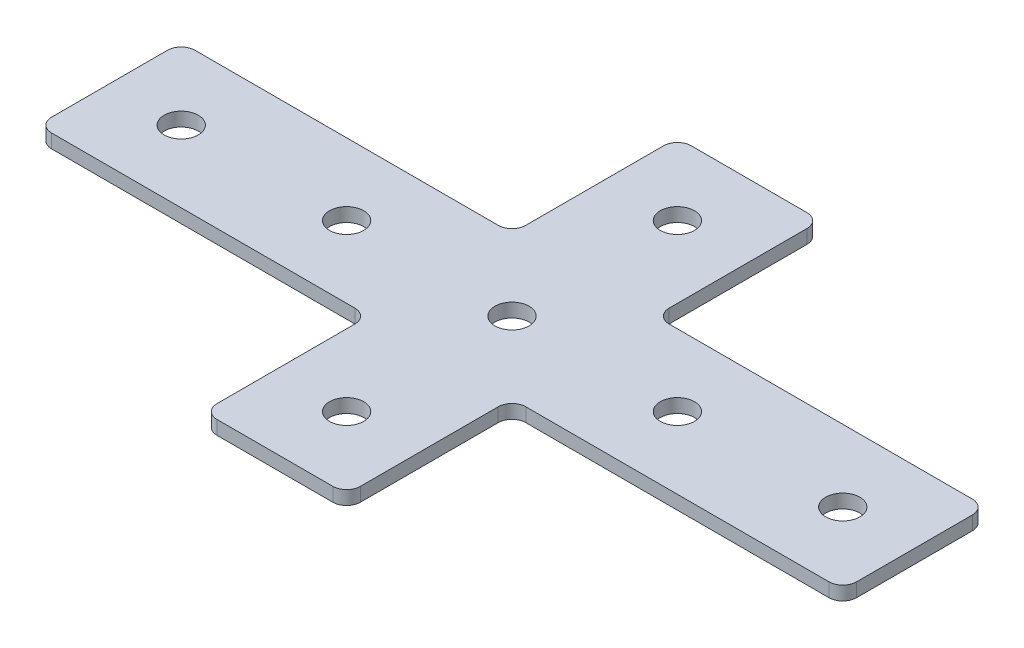
ISO-10303-21;
HEADER;
FILE_DESCRIPTION(('STEP AP214'),'2;1');
FILE_NAME('part.step','',(''),(''),'','','');
FILE_SCHEMA(('AUTOMOTIVE_DESIGN { 1 0 10303 214 1 1 1 1 }'));
ENDSEC;
DATA;
#1=APPLICATION_CONTEXT('core data for automotive mechanical design processes');
#2=APPLICATION_PROTOCOL_DEFINITION('international standard','automotive_design',2000,#1);
#3=PRODUCT_CONTEXT('',#1,'mechanical');
#4=PRODUCT('Part','Part','',(#3));
#5=PRODUCT_RELATED_PRODUCT_CATEGORY('part','',(#4));
#6=PRODUCT_DEFINITION_FORMATION('','',#4);
#7=PRODUCT_DEFINITION_CONTEXT('part definition',#1,'design');
#8=PRODUCT_DEFINITION('design','',#6,#7);
#9=PRODUCT_DEFINITION_SHAPE('','',#8);
#10=(LENGTH_UNIT() NAMED_UNIT(*) SI_UNIT(.MILLI.,.METRE.));
#11=(NAMED_UNIT(*) PLANE_ANGLE_UNIT() SI_UNIT($,.RADIAN.));
#12=(NAMED_UNIT(*) SI_UNIT($,.STERADIAN.) SOLID_ANGLE_UNIT());
#13=UNCERTAINTY_MEASURE_WITH_UNIT(LENGTH_MEASURE(1.E-05),#10,'distance_accuracy_value','');
#14=(GEOMETRIC_REPRESENTATION_CONTEXT(3) GLOBAL_UNCERTAINTY_ASSIGNED_CONTEXT((#13)) GLOBAL_UNIT_ASSIGNED_CONTEXT((#10,
#11,#12)) REPRESENTATION_CONTEXT('',''));
#15=CARTESIAN_POINT('',(0.,0.,0.));
#16=DIRECTION('',(0.,0.,1.));
#17=DIRECTION('',(1.,0.,0.));
#18=AXIS2_PLACEMENT_3D('',#15,#16,#17);
#19=CARTESIAN_POINT('',(-1.34521083117534,1.24134831028641,-1.14573259799045));
#20=DIRECTION('',(0.,-1.,0.));
#21=DIRECTION('',(0.,0.,-1.));
#22=AXIS2_PLACEMENT_3D('',#19,#20,#21);
#23=PLANE('',#22);
#24=CARTESIAN_POINT('',(-31.3452108311753,1.24134831028641,-1.14573259799043));
#25=DIRECTION('',(0.,-1.,0.));
#26=DIRECTION('',(0.,0.,1.));
#27=AXIS2_PLACEMENT_3D('',#24,#25,#26);
#28=CIRCLE('',#27,3.1);
#29=CARTESIAN_POINT('',(-31.3452108311753,1.24134831028641,1.95426740200957));
#30=VERTEX_POINT('',#29);
#31=EDGE_CURVE('E254',#30,#30,#28,.T.);
#32=ORIENTED_EDGE('',*,*,#31,.F.);
#33=EDGE_LOOP('',(#32));
#34=FACE_BOUND('',#33,.T.);
#35=CARTESIAN_POINT('',(-61.3452108311753,1.24134831028641,-1.14573259799043));
#36=DIRECTION('',(0.,-1.,0.));
#37=DIRECTION('',(0.,0.,1.));
#38=AXIS2_PLACEMENT_3D('',#35,#36,#37);
#39=CIRCLE('',#38,3.1);
#40=CARTESIAN_POINT('',(-61.3452108311753,1.24134831028641,1.95426740200957));
#41=VERTEX_POINT('',#40);
#42=EDGE_CURVE('E248',#41,#41,#39,.T.);
#43=ORIENTED_EDGE('',*,*,#42,.F.);
#44=EDGE_LOOP('',(#43));
#45=FACE_BOUND('',#44,.T.);
#46=CARTESIAN_POINT('',(-1.34521083117534,1.24134831028641,-1.14573259799045));
#47=DIRECTION('',(0.,1.,0.));
#48=DIRECTION('',(0.,0.,1.));
#49=AXIS2_PLACEMENT_3D('',#46,#47,#48);
#50=CIRCLE('',#49,3.1);
#51=CARTESIAN_POINT('',(-1.34521083117534,1.24134831028641,1.95426740200955));
#52=VERTEX_POINT('',#51);
#53=EDGE_CURVE('E324',#52,#52,#50,.T.);
#54=ORIENTED_EDGE('',*,*,#53,.T.);
#55=EDGE_LOOP('',(#54));
#56=FACE_BOUND('',#55,.T.);
#57=CARTESIAN_POINT('',(69.1547891688245,1.24134831028641,-11.6457325979905));
#58=DIRECTION('',(0.,1.,0.));
#59=DIRECTION('',(0.,0.,1.));
#60=AXIS2_PLACEMENT_3D('',#57,#58,#59);
#61=CIRCLE('',#60,2.5);
#62=CARTESIAN_POINT('',(71.6547891688245,1.24134831028641,-11.6457325979905));
#63=VERTEX_POINT('',#62);
#64=CARTESIAN_POINT('',(69.1547891688245,1.24134831028641,-14.1457325979905));
#65=VERTEX_POINT('',#64);
#66=EDGE_CURVE('E228',#63,#65,#61,.T.);
#67=ORIENTED_EDGE('',*,*,#66,.F.);
#68=DIRECTION('',(0.,0.,-1.));
#69=VECTOR('',#68,1.);
#70=CARTESIAN_POINT('',(71.6547891688245,1.24134831028641,11.8542674020096));
#71=LINE('',#70,#69);
#72=CARTESIAN_POINT('',(71.6547891688245,1.24134831028641,9.35426740200959));
#73=VERTEX_POINT('',#72);
#74=EDGE_CURVE('E332',#73,#63,#71,.T.);
#75=ORIENTED_EDGE('',*,*,#74,.F.);
#76=CARTESIAN_POINT('',(69.1547891688245,1.24134831028641,9.35426740200959));
#77=DIRECTION('',(0.,-1.,0.));
#78=DIRECTION('',(0.,0.,-1.));
#79=AXIS2_PLACEMENT_3D('',#76,#77,#78);
#80=CIRCLE('',#79,2.5);
#81=CARTESIAN_POINT('',(69.1547891688245,1.24134831028641,11.8542674020096));
#82=VERTEX_POINT('',#81);
#83=EDGE_CURVE('E31',#73,#82,#80,.T.);
#84=ORIENTED_EDGE('',*,*,#83,.T.);
#85=DIRECTION('',(1.,0.,0.));
#86=VECTOR('',#85,1.);
#87=CARTESIAN_POINT('',(11.6547891688248,1.24134831028641,11.8542674020096));
#88=LINE('',#87,#86);
#89=CARTESIAN_POINT('',(14.1547891688248,1.24134831028641,11.8542674020096));
#90=VERTEX_POINT('',#89);
#91=EDGE_CURVE('E330',#90,#82,#88,.T.);
#92=ORIENTED_EDGE('',*,*,#91,.F.);
#93=CARTESIAN_POINT('',(14.1547891688248,1.24134831028641,14.3542674020096));
#94=DIRECTION('',(0.,-1.,0.));
#95=DIRECTION('',(0.,0.,-1.));
#96=AXIS2_PLACEMENT_3D('',#93,#94,#95);
#97=CIRCLE('',#96,2.5);
#98=CARTESIAN_POINT('',(11.6547891688248,1.24134831028641,14.3542674020096));
#99=VERTEX_POINT('',#98);
#100=EDGE_CURVE('E10',#90,#99,#97,.F.);
#101=ORIENTED_EDGE('',*,*,#100,.T.);
#102=DIRECTION('',(0.,0.,-1.));
#103=VECTOR('',#102,1.);
#104=CARTESIAN_POINT('',(11.6547891688248,1.24134831028641,41.8542674020095));
#105=LINE('',#104,#103);
#106=CARTESIAN_POINT('',(11.6547891688248,1.24134831028641,39.3542674020095));
#107=VERTEX_POINT('',#106);
#108=EDGE_CURVE('E337',#107,#99,#105,.T.);
#109=ORIENTED_EDGE('',*,*,#108,.F.);
#110=CARTESIAN_POINT('',(9.15478916882477,1.24134831028641,39.3542674020095));
#111=DIRECTION('',(0.,-1.,0.));
#112=DIRECTION('',(0.,0.,-1.));
#113=AXIS2_PLACEMENT_3D('',#110,#111,#112);
#114=CIRCLE('',#113,2.5);
#115=CARTESIAN_POINT('',(9.15478916882477,1.24134831028641,41.8542674020095));
#116=VERTEX_POINT('',#115);
#117=EDGE_CURVE('E361',#107,#116,#114,.T.);
#118=ORIENTED_EDGE('',*,*,#117,.T.);
#119=DIRECTION('',(1.,0.,0.));
#120=VECTOR('',#119,1.);
#121=CARTESIAN_POINT('',(-14.3452108311754,1.24134831028641,41.8542674020095));
#122=LINE('',#121,#120);
#123=CARTESIAN_POINT('',(-11.8452108311754,1.24134831028641,41.8542674020095));
#124=VERTEX_POINT('',#123);
#125=EDGE_CURVE('E335',#124,#116,#122,.T.);
#126=ORIENTED_EDGE('',*,*,#125,.F.);
#127=CARTESIAN_POINT('',(-11.8452108311754,1.24134831028641,39.3542674020095));
#128=DIRECTION('',(0.,1.,0.));
#129=DIRECTION('',(0.,0.,-1.));
#130=AXIS2_PLACEMENT_3D('',#127,#128,#129);
#131=CIRCLE('',#130,2.5);
#132=CARTESIAN_POINT('',(-14.3452108311754,1.24134831028641,39.3542674020095));
#133=VERTEX_POINT('',#132);
#134=EDGE_CURVE('E290',#133,#124,#131,.T.);
#135=ORIENTED_EDGE('',*,*,#134,.F.);
#136=DIRECTION('',(0.,0.,-1.));
#137=VECTOR('',#136,1.);
#138=CARTESIAN_POINT('',(-14.3452108311754,1.24134831028641,41.8542674020095));
#139=LINE('',#138,#137);
#140=CARTESIAN_POINT('',(-14.3452108311754,1.24134831028641,14.3542674020096));
#141=VERTEX_POINT('',#140);
#142=EDGE_CURVE('E266',#133,#141,#139,.T.);
#143=ORIENTED_EDGE('',*,*,#142,.T.);
#144=CARTESIAN_POINT('',(-16.8452108311754,1.24134831028641,14.3542674020096));
#145=DIRECTION('',(0.,1.,0.));
#146=DIRECTION('',(0.,0.,-1.));
#147=AXIS2_PLACEMENT_3D('',#144,#145,#146);
#148=CIRCLE('',#147,2.5);
#149=CARTESIAN_POINT('',(-16.8452108311754,1.24134831028641,11.8542674020096));
#150=VERTEX_POINT('',#149);
#151=EDGE_CURVE('E302',#150,#141,#148,.F.);
#152=ORIENTED_EDGE('',*,*,#151,.F.);
#153=DIRECTION('',(-1.,0.,0.));
#154=VECTOR('',#153,1.);
#155=CARTESIAN_POINT('',(-14.3452108311754,1.24134831028641,11.8542674020096));
#156=LINE('',#155,#154);
#157=CARTESIAN_POINT('',(-71.8452108311752,1.24134831028641,11.8542674020096));
#158=VERTEX_POINT('',#157);
#159=EDGE_CURVE('E260',#150,#158,#156,.T.);
#160=ORIENTED_EDGE('',*,*,#159,.T.);
#161=CARTESIAN_POINT('',(-71.8452108311752,1.24134831028641,9.35426740200961));
#162=DIRECTION('',(0.,1.,0.));
#163=DIRECTION('',(0.,0.,-1.));
#164=AXIS2_PLACEMENT_3D('',#161,#162,#163);
#165=CIRCLE('',#164,2.5);
#166=CARTESIAN_POINT('',(-74.3452108311752,1.24134831028641,9.35426740200961));
#167=VERTEX_POINT('',#166);
#168=EDGE_CURVE('E287',#167,#158,#165,.T.);
#169=ORIENTED_EDGE('',*,*,#168,.F.);
#170=DIRECTION('',(0.,0.,-1.));
#171=VECTOR('',#170,1.);
#172=CARTESIAN_POINT('',(-74.3452108311752,1.24134831028641,11.8542674020096));
#173=LINE('',#172,#171);
#174=CARTESIAN_POINT('',(-74.3452108311752,1.24134831028641,-11.6457325979905));
#175=VERTEX_POINT('',#174);
#176=EDGE_CURVE('E263',#167,#175,#173,.T.);
#177=ORIENTED_EDGE('',*,*,#176,.T.);
#178=CARTESIAN_POINT('',(-71.8452108311752,1.24134831028641,-11.6457325979905));
#179=DIRECTION('',(0.,-1.,0.));
#180=DIRECTION('',(0.,0.,1.));
#181=AXIS2_PLACEMENT_3D('',#178,#179,#180);
#182=CIRCLE('',#181,2.5);
#183=CARTESIAN_POINT('',(-71.8452108311752,1.24134831028641,-14.1457325979905));
#184=VERTEX_POINT('',#183);
#185=EDGE_CURVE('E416',#175,#184,#182,.T.);
#186=ORIENTED_EDGE('',*,*,#185,.T.);
#187=DIRECTION('',(-1.,0.,0.));
#188=VECTOR('',#187,1.);
#189=CARTESIAN_POINT('',(-14.3452108311754,1.24134831028641,-14.1457325979905));
#190=LINE('',#189,#188);
#191=CARTESIAN_POINT('',(-16.8452108311754,1.24134831028641,-14.1457325979905));
#192=VERTEX_POINT('',#191);
#193=EDGE_CURVE('E778',#192,#184,#190,.T.);
#194=ORIENTED_EDGE('',*,*,#193,.F.);
#195=CARTESIAN_POINT('',(-16.8452108311754,1.24134831028641,-16.6457325979905));
#196=DIRECTION('',(0.,-1.,0.));
#197=DIRECTION('',(0.,0.,1.));
#198=AXIS2_PLACEMENT_3D('',#195,#196,#197);
#199=CIRCLE('',#198,2.5);
#200=CARTESIAN_POINT('',(-14.3452108311754,1.24134831028641,-16.6457325979905));
#201=VERTEX_POINT('',#200);
#202=EDGE_CURVE('E441',#192,#201,#199,.F.);
#203=ORIENTED_EDGE('',*,*,#202,.T.);
#204=DIRECTION('',(0.,0.,1.));
#205=VECTOR('',#204,1.);
#206=CARTESIAN_POINT('',(-14.3452108311754,1.24134831028641,-44.1457325979904));
#207=LINE('',#206,#205);
#208=CARTESIAN_POINT('',(-14.3452108311754,1.24134831028641,-41.6457325979904));
#209=VERTEX_POINT('',#208);
#210=EDGE_CURVE('E190',#209,#201,#207,.T.);
#211=ORIENTED_EDGE('',*,*,#210,.F.);
#212=CARTESIAN_POINT('',(-11.8452108311754,1.24134831028641,-41.6457325979904));
#213=DIRECTION('',(0.,-1.,0.));
#214=DIRECTION('',(0.,0.,1.));
#215=AXIS2_PLACEMENT_3D('',#212,#213,#214);
#216=CIRCLE('',#215,2.5);
#217=CARTESIAN_POINT('',(-11.8452108311754,1.24134831028641,-44.1457325979904));
#218=VERTEX_POINT('',#217);
#219=EDGE_CURVE('E431',#209,#218,#216,.T.);
#220=ORIENTED_EDGE('',*,*,#219,.T.);
#221=DIRECTION('',(1.,0.,0.));
#222=VECTOR('',#221,1.);
#223=CARTESIAN_POINT('',(-14.3452108311754,1.24134831028641,-44.1457325979904));
#224=LINE('',#223,#222);
#225=CARTESIAN_POINT('',(9.15478916882477,1.24134831028641,-44.1457325979904));
#226=VERTEX_POINT('',#225);
#227=EDGE_CURVE('E185',#218,#226,#224,.T.);
#228=ORIENTED_EDGE('',*,*,#227,.T.);
#229=CARTESIAN_POINT('',(9.15478916882477,1.24134831028641,-41.6457325979904));
#230=DIRECTION('',(0.,1.,0.));
#231=DIRECTION('',(0.,0.,1.));
#232=AXIS2_PLACEMENT_3D('',#229,#230,#231);
#233=CIRCLE('',#232,2.5);
#234=CARTESIAN_POINT('',(11.6547891688248,1.24134831028641,-41.6457325979904));
#235=VERTEX_POINT('',#234);
#236=EDGE_CURVE('E231',#235,#226,#233,.T.);
#237=ORIENTED_EDGE('',*,*,#236,.F.);
#238=DIRECTION('',(0.,0.,1.));
#239=VECTOR('',#238,1.);
#240=CARTESIAN_POINT('',(11.6547891688248,1.24134831028641,-44.1457325979904));
#241=LINE('',#240,#239);
#242=CARTESIAN_POINT('',(11.6547891688248,1.24134831028641,-16.6457325979905));
#243=VERTEX_POINT('',#242);
#244=EDGE_CURVE('E220',#235,#243,#241,.T.);
#245=ORIENTED_EDGE('',*,*,#244,.T.);
#246=CARTESIAN_POINT('',(14.1547891688248,1.24134831028641,-16.6457325979905));
#247=DIRECTION('',(0.,1.,0.));
#248=DIRECTION('',(0.,0.,1.));
#249=AXIS2_PLACEMENT_3D('',#246,#247,#248);
#250=CIRCLE('',#249,2.5);
#251=CARTESIAN_POINT('',(14.1547891688248,1.24134831028641,-14.1457325979905));
#252=VERTEX_POINT('',#251);
#253=EDGE_CURVE('E244',#252,#243,#250,.F.);
#254=ORIENTED_EDGE('',*,*,#253,.F.);
#255=DIRECTION('',(1.,0.,0.));
#256=VECTOR('',#255,1.);
#257=CARTESIAN_POINT('',(11.6547891688248,1.24134831028641,-14.1457325979905));
#258=LINE('',#257,#256);
#259=EDGE_CURVE('E210',#252,#65,#258,.T.);
#260=ORIENTED_EDGE('',*,*,#259,.T.);
#261=EDGE_LOOP('',(#67,#75,#84,#92,#101,#109,#118,#126,#135,#143,#152,#160,#169,#177,#186,#194,
#203,#211,#220,#228,#237,#245,#254,#260));
#262=FACE_BOUND('',#261,.T.);
#263=CARTESIAN_POINT('',(58.6547891688247,1.24134831028641,-1.14573259799045));
#264=DIRECTION('',(0.,1.,0.));
#265=DIRECTION('',(0.,0.,1.));
#266=AXIS2_PLACEMENT_3D('',#263,#264,#265);
#267=CIRCLE('',#266,3.1);
#268=CARTESIAN_POINT('',(58.6547891688247,1.24134831028641,1.95426740200956));
#269=VERTEX_POINT('',#268);
#270=EDGE_CURVE('E306',#269,#269,#267,.T.);
#271=ORIENTED_EDGE('',*,*,#270,.T.);
#272=EDGE_LOOP('',(#271));
#273=FACE_BOUND('',#272,.T.);
#274=CARTESIAN_POINT('',(-1.34521083117535,1.24134831028641,28.8542674020096));
#275=DIRECTION('',(0.,1.,0.));
#276=DIRECTION('',(0.,0.,1.));
#277=AXIS2_PLACEMENT_3D('',#274,#275,#276);
#278=CIRCLE('',#277,3.1);
#279=CARTESIAN_POINT('',(-1.34521083117535,1.24134831028641,31.9542674020096));
#280=VERTEX_POINT('',#279);
#281=EDGE_CURVE('E312',#280,#280,#278,.T.);
#282=ORIENTED_EDGE('',*,*,#281,.T.);
#283=EDGE_LOOP('',(#282));
#284=FACE_BOUND('',#283,.T.);
#285=CARTESIAN_POINT('',(28.6547891688247,1.24134831028641,-1.14573259799043));
#286=DIRECTION('',(0.,1.,0.));
#287=DIRECTION('',(0.,0.,1.));
#288=AXIS2_PLACEMENT_3D('',#285,#286,#287);
#289=CIRCLE('',#288,3.1);
#290=CARTESIAN_POINT('',(28.6547891688247,1.24134831028641,1.95426740200957));
#291=VERTEX_POINT('',#290);
#292=EDGE_CURVE('E318',#291,#291,#289,.T.);
#293=ORIENTED_EDGE('',*,*,#292,.T.);
#294=EDGE_LOOP('',(#293));
#295=FACE_BOUND('',#294,.T.);
#296=CARTESIAN_POINT('',(-1.34521083117535,1.24134831028641,-31.1457325979904));
#297=DIRECTION('',(0.,-1.,0.));
#298=DIRECTION('',(0.,0.,-1.));
#299=AXIS2_PLACEMENT_3D('',#296,#297,#298);
#300=CIRCLE('',#299,3.1);
#301=CARTESIAN_POINT('',(-1.34521083117535,1.24134831028641,-34.2457325979904));
#302=VERTEX_POINT('',#301);
#303=EDGE_CURVE('E213',#302,#302,#300,.T.);
#304=ORIENTED_EDGE('',*,*,#303,.F.);
#305=EDGE_LOOP('',(#304));
#306=FACE_BOUND('',#305,.T.);
#307=ADVANCED_FACE('F16',(#34,#45,#56,#262,#273,#284,#295,#306),#23,.T.);
#308=CARTESIAN_POINT('',(71.6547891688245,1.24134831028641,11.8542674020096));
#309=DIRECTION('',(1.,0.,0.));
#310=DIRECTION('',(0.,0.,-1.));
#311=AXIS2_PLACEMENT_3D('',#308,#309,#310);
#312=PLANE('',#311);
#313=ORIENTED_EDGE('',*,*,#74,.T.);
#314=DIRECTION('',(0.,1.,0.));
#315=VECTOR('',#314,1.);
#316=CARTESIAN_POINT('',(71.6547891688245,1.24134831028641,-11.6457325979905));
#317=LINE('',#316,#315);
#318=CARTESIAN_POINT('',(71.6547891688245,3.74134831028641,-11.6457325979905));
#319=VERTEX_POINT('',#318);
#320=EDGE_CURVE('E238',#319,#63,#317,.F.);
#321=ORIENTED_EDGE('',*,*,#320,.F.);
#322=DIRECTION('',(0.,0.,-1.));
#323=VECTOR('',#322,1.);
#324=CARTESIAN_POINT('',(71.6547891688245,3.74134831028641,11.8542674020096));
#325=LINE('',#324,#323);
#326=CARTESIAN_POINT('',(71.6547891688245,3.74134831028641,9.35426740200959));
#327=VERTEX_POINT('',#326);
#328=EDGE_CURVE('E343',#327,#319,#325,.T.);
#329=ORIENTED_EDGE('',*,*,#328,.F.);
#330=DIRECTION('',(0.,1.,0.));
#331=VECTOR('',#330,1.);
#332=CARTESIAN_POINT('',(71.6547891688245,1.24134831028641,9.35426740200959));
#333=LINE('',#332,#331);
#334=EDGE_CURVE('E368',#327,#73,#333,.F.);
#335=ORIENTED_EDGE('',*,*,#334,.T.);
#336=EDGE_LOOP('',(#313,#321,#329,#335));
#337=FACE_BOUND('',#336,.T.);
#338=ADVANCED_FACE('F470',(#337),#312,.T.);
#339=CARTESIAN_POINT('',(-1.34521083117534,3.74134831028641,-1.14573259799045));
#340=DIRECTION('',(0.,-1.,0.));
#341=DIRECTION('',(0.,0.,-1.));
#342=AXIS2_PLACEMENT_3D('',#339,#340,#341);
#343=PLANE('',#342);
#344=CARTESIAN_POINT('',(-31.3452108311753,3.74134831028641,-1.14573259799043));
#345=DIRECTION('',(0.,-1.,0.));
#346=DIRECTION('',(0.,0.,1.));
#347=AXIS2_PLACEMENT_3D('',#344,#345,#346);
#348=CIRCLE('',#347,3.1);
#349=CARTESIAN_POINT('',(-31.3452108311753,3.74134831028641,1.95426740200957));
#350=VERTEX_POINT('',#349);
#351=EDGE_CURVE('E251',#350,#350,#348,.T.);
#352=ORIENTED_EDGE('',*,*,#351,.T.);
#353=EDGE_LOOP('',(#352));
#354=FACE_BOUND('',#353,.T.);
#355=CARTESIAN_POINT('',(-61.3452108311753,3.74134831028641,-1.14573259799043));
#356=DIRECTION('',(0.,-1.,0.));
#357=DIRECTION('',(0.,0.,1.));
#358=AXIS2_PLACEMENT_3D('',#355,#356,#357);
#359=CIRCLE('',#358,3.1);
#360=CARTESIAN_POINT('',(-61.3452108311753,3.74134831028641,1.95426740200957));
#361=VERTEX_POINT('',#360);
#362=EDGE_CURVE('E247',#361,#361,#359,.T.);
#363=ORIENTED_EDGE('',*,*,#362,.T.);
#364=EDGE_LOOP('',(#363));
#365=FACE_BOUND('',#364,.T.);
#366=CARTESIAN_POINT('',(-1.34521083117534,3.74134831028641,-1.14573259799045));
#367=DIRECTION('',(0.,1.,0.));
#368=DIRECTION('',(0.,0.,1.));
#369=AXIS2_PLACEMENT_3D('',#366,#367,#368);
#370=CIRCLE('',#369,3.1);
#371=CARTESIAN_POINT('',(-1.34521083117534,3.74134831028641,1.95426740200955));
#372=VERTEX_POINT('',#371);
#373=EDGE_CURVE('E321',#372,#372,#370,.T.);
#374=ORIENTED_EDGE('',*,*,#373,.F.);
#375=EDGE_LOOP('',(#374));
#376=FACE_BOUND('',#375,.T.);
#377=ORIENTED_EDGE('',*,*,#328,.T.);
#378=CARTESIAN_POINT('',(69.1547891688245,3.74134831028641,-11.6457325979905));
#379=DIRECTION('',(0.,1.,0.));
#380=DIRECTION('',(0.,0.,1.));
#381=AXIS2_PLACEMENT_3D('',#378,#379,#380);
#382=CIRCLE('',#381,2.5);
#383=CARTESIAN_POINT('',(69.1547891688245,3.74134831028641,-14.1457325979905));
#384=VERTEX_POINT('',#383);
#385=EDGE_CURVE('E219',#384,#319,#382,.F.);
#386=ORIENTED_EDGE('',*,*,#385,.F.);
#387=DIRECTION('',(1.,0.,0.));
#388=VECTOR('',#387,1.);
#389=CARTESIAN_POINT('',(11.6547891688248,3.74134831028641,-14.1457325979905));
#390=LINE('',#389,#388);
#391=CARTESIAN_POINT('',(14.1547891688248,3.74134831028641,-14.1457325979905));
#392=VERTEX_POINT('',#391);
#393=EDGE_CURVE('E207',#392,#384,#390,.T.);
#394=ORIENTED_EDGE('',*,*,#393,.F.);
#395=CARTESIAN_POINT('',(14.1547891688248,3.74134831028641,-16.6457325979905));
#396=DIRECTION('',(0.,1.,0.));
#397=DIRECTION('',(0.,0.,1.));
#398=AXIS2_PLACEMENT_3D('',#395,#396,#397);
#399=CIRCLE('',#398,2.5);
#400=CARTESIAN_POINT('',(11.6547891688248,3.74134831028641,-16.6457325979905));
#401=VERTEX_POINT('',#400);
#402=EDGE_CURVE('E241',#401,#392,#399,.T.);
#403=ORIENTED_EDGE('',*,*,#402,.F.);
#404=DIRECTION('',(0.,0.,1.));
#405=VECTOR('',#404,1.);
#406=CARTESIAN_POINT('',(11.6547891688248,3.74134831028641,-44.1457325979904));
#407=LINE('',#406,#405);
#408=CARTESIAN_POINT('',(11.6547891688248,3.74134831028641,-41.6457325979904));
#409=VERTEX_POINT('',#408);
#410=EDGE_CURVE('E206',#409,#401,#407,.T.);
#411=ORIENTED_EDGE('',*,*,#410,.F.);
#412=CARTESIAN_POINT('',(9.15478916882477,3.74134831028641,-41.6457325979904));
#413=DIRECTION('',(0.,1.,0.));
#414=DIRECTION('',(0.,0.,1.));
#415=AXIS2_PLACEMENT_3D('',#412,#413,#414);
#416=CIRCLE('',#415,2.5);
#417=CARTESIAN_POINT('',(9.15478916882477,3.74134831028641,-44.1457325979904));
#418=VERTEX_POINT('',#417);
#419=EDGE_CURVE('E205',#418,#409,#416,.F.);
#420=ORIENTED_EDGE('',*,*,#419,.F.);
#421=DIRECTION('',(1.,0.,0.));
#422=VECTOR('',#421,1.);
#423=CARTESIAN_POINT('',(-14.3452108311754,3.74134831028641,-44.1457325979904));
#424=LINE('',#423,#422);
#425=CARTESIAN_POINT('',(-11.8452108311754,3.74134831028641,-44.1457325979904));
#426=VERTEX_POINT('',#425);
#427=EDGE_CURVE('E182',#426,#418,#424,.T.);
#428=ORIENTED_EDGE('',*,*,#427,.F.);
#429=CARTESIAN_POINT('',(-11.8452108311754,3.74134831028641,-41.6457325979904));
#430=DIRECTION('',(0.,-1.,0.));
#431=DIRECTION('',(0.,0.,1.));
#432=AXIS2_PLACEMENT_3D('',#429,#430,#431);
#433=CIRCLE('',#432,2.5);
#434=CARTESIAN_POINT('',(-14.3452108311754,3.74134831028641,-41.6457325979904));
#435=VERTEX_POINT('',#434);
#436=EDGE_CURVE('E193',#426,#435,#433,.F.);
#437=ORIENTED_EDGE('',*,*,#436,.T.);
#438=DIRECTION('',(0.,0.,1.));
#439=VECTOR('',#438,1.);
#440=CARTESIAN_POINT('',(-14.3452108311754,3.74134831028641,-44.1457325979904));
#441=LINE('',#440,#439);
#442=CARTESIAN_POINT('',(-14.3452108311754,3.74134831028641,-16.6457325979905));
#443=VERTEX_POINT('',#442);
#444=EDGE_CURVE('E779',#435,#443,#441,.T.);
#445=ORIENTED_EDGE('',*,*,#444,.T.);
#446=CARTESIAN_POINT('',(-16.8452108311754,3.74134831028641,-16.6457325979905));
#447=DIRECTION('',(0.,-1.,0.));
#448=DIRECTION('',(0.,0.,1.));
#449=AXIS2_PLACEMENT_3D('',#446,#447,#448);
#450=CIRCLE('',#449,2.5);
#451=CARTESIAN_POINT('',(-16.8452108311754,3.74134831028641,-14.1457325979905));
#452=VERTEX_POINT('',#451);
#453=EDGE_CURVE('E425',#443,#452,#450,.T.);
#454=ORIENTED_EDGE('',*,*,#453,.T.);
#455=DIRECTION('',(-1.,0.,0.));
#456=VECTOR('',#455,1.);
#457=CARTESIAN_POINT('',(-14.3452108311754,3.74134831028641,-14.1457325979905));
#458=LINE('',#457,#456);
#459=CARTESIAN_POINT('',(-71.8452108311752,3.74134831028641,-14.1457325979905));
#460=VERTEX_POINT('',#459);
#461=EDGE_CURVE('E782',#452,#460,#458,.T.);
#462=ORIENTED_EDGE('',*,*,#461,.T.);
#463=CARTESIAN_POINT('',(-71.8452108311752,3.74134831028641,-11.6457325979905));
#464=DIRECTION('',(0.,-1.,0.));
#465=DIRECTION('',(0.,0.,1.));
#466=AXIS2_PLACEMENT_3D('',#463,#464,#465);
#467=CIRCLE('',#466,2.5);
#468=CARTESIAN_POINT('',(-74.3452108311752,3.74134831028641,-11.6457325979905));
#469=VERTEX_POINT('',#468);
#470=EDGE_CURVE('E189',#460,#469,#467,.F.);
#471=ORIENTED_EDGE('',*,*,#470,.T.);
#472=DIRECTION('',(0.,0.,-1.));
#473=VECTOR('',#472,1.);
#474=CARTESIAN_POINT('',(-74.3452108311752,3.74134831028641,11.8542674020096));
#475=LINE('',#474,#473);
#476=CARTESIAN_POINT('',(-74.3452108311752,3.74134831028641,9.35426740200961));
#477=VERTEX_POINT('',#476);
#478=EDGE_CURVE('E272',#477,#469,#475,.T.);
#479=ORIENTED_EDGE('',*,*,#478,.F.);
#480=CARTESIAN_POINT('',(-71.8452108311752,3.74134831028641,9.35426740200961));
#481=DIRECTION('',(0.,1.,0.));
#482=DIRECTION('',(0.,0.,-1.));
#483=AXIS2_PLACEMENT_3D('',#480,#481,#482);
#484=CIRCLE('',#483,2.5);
#485=CARTESIAN_POINT('',(-71.8452108311752,3.74134831028641,11.8542674020096));
#486=VERTEX_POINT('',#485);
#487=EDGE_CURVE('E278',#486,#477,#484,.F.);
#488=ORIENTED_EDGE('',*,*,#487,.F.);
#489=DIRECTION('',(-1.,0.,0.));
#490=VECTOR('',#489,1.);
#491=CARTESIAN_POINT('',(-14.3452108311754,3.74134831028641,11.8542674020096));
#492=LINE('',#491,#490);
#493=CARTESIAN_POINT('',(-16.8452108311754,3.74134831028641,11.8542674020096));
#494=VERTEX_POINT('',#493);
#495=EDGE_CURVE('E257',#494,#486,#492,.T.);
#496=ORIENTED_EDGE('',*,*,#495,.F.);
#497=CARTESIAN_POINT('',(-16.8452108311754,3.74134831028641,14.3542674020096));
#498=DIRECTION('',(0.,1.,0.));
#499=DIRECTION('',(0.,0.,-1.));
#500=AXIS2_PLACEMENT_3D('',#497,#498,#499);
#501=CIRCLE('',#500,2.5);
#502=CARTESIAN_POINT('',(-14.3452108311754,3.74134831028641,14.3542674020096));
#503=VERTEX_POINT('',#502);
#504=EDGE_CURVE('E300',#503,#494,#501,.T.);
#505=ORIENTED_EDGE('',*,*,#504,.F.);
#506=DIRECTION('',(0.,0.,-1.));
#507=VECTOR('',#506,1.);
#508=CARTESIAN_POINT('',(-14.3452108311754,3.74134831028641,41.8542674020095));
#509=LINE('',#508,#507);
#510=CARTESIAN_POINT('',(-14.3452108311754,3.74134831028641,39.3542674020095));
#511=VERTEX_POINT('',#510);
#512=EDGE_CURVE('E264',#511,#503,#509,.T.);
#513=ORIENTED_EDGE('',*,*,#512,.F.);
#514=CARTESIAN_POINT('',(-11.8452108311754,3.74134831028641,39.3542674020095));
#515=DIRECTION('',(0.,1.,0.));
#516=DIRECTION('',(0.,0.,-1.));
#517=AXIS2_PLACEMENT_3D('',#514,#515,#516);
#518=CIRCLE('',#517,2.5);
#519=CARTESIAN_POINT('',(-11.8452108311754,3.74134831028641,41.8542674020095));
#520=VERTEX_POINT('',#519);
#521=EDGE_CURVE('E280',#520,#511,#518,.F.);
#522=ORIENTED_EDGE('',*,*,#521,.F.);
#523=DIRECTION('',(1.,0.,0.));
#524=VECTOR('',#523,1.);
#525=CARTESIAN_POINT('',(-14.3452108311754,3.74134831028641,41.8542674020095));
#526=LINE('',#525,#524);
#527=CARTESIAN_POINT('',(9.15478916882477,3.74134831028641,41.8542674020095));
#528=VERTEX_POINT('',#527);
#529=EDGE_CURVE('E345',#520,#528,#526,.T.);
#530=ORIENTED_EDGE('',*,*,#529,.T.);
#531=CARTESIAN_POINT('',(9.15478916882477,3.74134831028641,39.3542674020095));
#532=DIRECTION('',(0.,-1.,0.));
#533=DIRECTION('',(0.,0.,-1.));
#534=AXIS2_PLACEMENT_3D('',#531,#532,#533);
#535=CIRCLE('',#534,2.5);
#536=CARTESIAN_POINT('',(11.6547891688248,3.74134831028641,39.3542674020095));
#537=VERTEX_POINT('',#536);
#538=EDGE_CURVE('E353',#528,#537,#535,.F.);
#539=ORIENTED_EDGE('',*,*,#538,.T.);
#540=DIRECTION('',(0.,0.,-1.));
#541=VECTOR('',#540,1.);
#542=CARTESIAN_POINT('',(11.6547891688248,3.74134831028641,41.8542674020095));
#543=LINE('',#542,#541);
#544=CARTESIAN_POINT('',(11.6547891688248,3.74134831028641,14.3542674020096));
#545=VERTEX_POINT('',#544);
#546=EDGE_CURVE('E333',#537,#545,#543,.T.);
#547=ORIENTED_EDGE('',*,*,#546,.T.);
#548=CARTESIAN_POINT('',(14.1547891688248,3.74134831028641,14.3542674020096));
#549=DIRECTION('',(0.,-1.,0.));
#550=DIRECTION('',(0.,0.,-1.));
#551=AXIS2_PLACEMENT_3D('',#548,#549,#550);
#552=CIRCLE('',#551,2.5);
#553=CARTESIAN_POINT('',(14.1547891688248,3.74134831028641,11.8542674020096));
#554=VERTEX_POINT('',#553);
#555=EDGE_CURVE('E24',#545,#554,#552,.T.);
#556=ORIENTED_EDGE('',*,*,#555,.T.);
#557=DIRECTION('',(1.,0.,0.));
#558=VECTOR('',#557,1.);
#559=CARTESIAN_POINT('',(11.6547891688248,3.74134831028641,11.8542674020096));
#560=LINE('',#559,#558);
#561=CARTESIAN_POINT('',(69.1547891688245,3.74134831028641,11.8542674020096));
#562=VERTEX_POINT('',#561);
#563=EDGE_CURVE('E327',#554,#562,#560,.T.);
#564=ORIENTED_EDGE('',*,*,#563,.T.);
#565=CARTESIAN_POINT('',(69.1547891688245,3.74134831028641,9.35426740200959));
#566=DIRECTION('',(0.,-1.,0.));
#567=DIRECTION('',(0.,0.,-1.));
#568=AXIS2_PLACEMENT_3D('',#565,#566,#567);
#569=CIRCLE('',#568,2.5);
#570=EDGE_CURVE('E351',#562,#327,#569,.F.);
#571=ORIENTED_EDGE('',*,*,#570,.T.);
#572=EDGE_LOOP('',(#377,#386,#394,#403,#411,#420,#428,#437,#445,#454,#462,#471,#479,#488,#496,
#505,#513,#522,#530,#539,#547,#556,#564,#571));
#573=FACE_BOUND('',#572,.T.);
#574=CARTESIAN_POINT('',(58.6547891688247,3.74134831028641,-1.14573259799045));
#575=DIRECTION('',(0.,1.,0.));
#576=DIRECTION('',(0.,0.,1.));
#577=AXIS2_PLACEMENT_3D('',#574,#575,#576);
#578=CIRCLE('',#577,3.1);
#579=CARTESIAN_POINT('',(58.6547891688247,3.74134831028641,1.95426740200956));
#580=VERTEX_POINT('',#579);
#581=EDGE_CURVE('E305',#580,#580,#578,.T.);
#582=ORIENTED_EDGE('',*,*,#581,.F.);
#583=EDGE_LOOP('',(#582));
#584=FACE_BOUND('',#583,.T.);
#585=CARTESIAN_POINT('',(-1.34521083117535,3.74134831028641,28.8542674020096));
#586=DIRECTION('',(0.,1.,0.));
#587=DIRECTION('',(0.,0.,1.));
#588=AXIS2_PLACEMENT_3D('',#585,#586,#587);
#589=CIRCLE('',#588,3.1);
#590=CARTESIAN_POINT('',(-1.34521083117535,3.74134831028641,31.9542674020096));
#591=VERTEX_POINT('',#590);
#592=EDGE_CURVE('E309',#591,#591,#589,.T.);
#593=ORIENTED_EDGE('',*,*,#592,.F.);
#594=EDGE_LOOP('',(#593));
#595=FACE_BOUND('',#594,.T.);
#596=CARTESIAN_POINT('',(28.6547891688247,3.74134831028641,-1.14573259799043));
#597=DIRECTION('',(0.,1.,0.));
#598=DIRECTION('',(0.,0.,1.));
#599=AXIS2_PLACEMENT_3D('',#596,#597,#598);
#600=CIRCLE('',#599,3.1);
#601=CARTESIAN_POINT('',(28.6547891688247,3.74134831028641,1.95426740200957));
#602=VERTEX_POINT('',#601);
#603=EDGE_CURVE('E315',#602,#602,#600,.T.);
#604=ORIENTED_EDGE('',*,*,#603,.F.);
#605=EDGE_LOOP('',(#604));
#606=FACE_BOUND('',#605,.T.);
#607=CARTESIAN_POINT('',(-1.34521083117535,3.74134831028641,-31.1457325979904));
#608=DIRECTION('',(0.,-1.,0.));
#609=DIRECTION('',(0.,0.,-1.));
#610=AXIS2_PLACEMENT_3D('',#607,#608,#609);
#611=CIRCLE('',#610,3.1);
#612=CARTESIAN_POINT('',(-1.34521083117535,3.74134831028641,-34.2457325979904));
#613=VERTEX_POINT('',#612);
#614=EDGE_CURVE('E444',#613,#613,#611,.T.);
#615=ORIENTED_EDGE('',*,*,#614,.T.);
#616=EDGE_LOOP('',(#615));
#617=FACE_BOUND('',#616,.T.);
#618=ADVANCED_FACE('F201',(#354,#365,#376,#573,#584,#595,#606,#617),#343,.F.);
#619=CARTESIAN_POINT('',(-1.34521083117534,1.24134831028641,-1.14573259799045));
#620=DIRECTION('',(0.,1.,0.));
#621=DIRECTION('',(0.,0.,1.));
#622=AXIS2_PLACEMENT_3D('',#619,#620,#621);
#623=CYLINDRICAL_SURFACE('',#622,3.1);
#624=ORIENTED_EDGE('',*,*,#53,.F.);
#625=EDGE_LOOP('',(#624));
#626=FACE_BOUND('',#625,.T.);
#627=ORIENTED_EDGE('',*,*,#373,.T.);
#628=EDGE_LOOP('',(#627));
#629=FACE_BOUND('',#628,.T.);
#630=ADVANCED_FACE('F540',(#626,#629),#623,.F.);
#631=CARTESIAN_POINT('',(28.6547891688247,1.24134831028641,-1.14573259799043));
#632=DIRECTION('',(0.,1.,0.));
#633=DIRECTION('',(0.,0.,1.));
#634=AXIS2_PLACEMENT_3D('',#631,#632,#633);
#635=CYLINDRICAL_SURFACE('',#634,3.1);
#636=ORIENTED_EDGE('',*,*,#603,.T.);
#637=EDGE_LOOP('',(#636));
#638=FACE_BOUND('',#637,.T.);
#639=ORIENTED_EDGE('',*,*,#292,.F.);
#640=EDGE_LOOP('',(#639));
#641=FACE_BOUND('',#640,.T.);
#642=ADVANCED_FACE('F536',(#638,#641),#635,.F.);
#643=CARTESIAN_POINT('',(58.6547891688247,1.24134831028641,-1.14573259799045));
#644=DIRECTION('',(0.,1.,0.));
#645=DIRECTION('',(0.,0.,1.));
#646=AXIS2_PLACEMENT_3D('',#643,#644,#645);
#647=CYLINDRICAL_SURFACE('',#646,3.1);
#648=ORIENTED_EDGE('',*,*,#581,.T.);
#649=EDGE_LOOP('',(#648));
#650=FACE_BOUND('',#649,.T.);
#651=ORIENTED_EDGE('',*,*,#270,.F.);
#652=EDGE_LOOP('',(#651));
#653=FACE_BOUND('',#652,.T.);
#654=ADVANCED_FACE('F526',(#650,#653),#647,.F.);
#655=CARTESIAN_POINT('',(-74.3452108311752,1.24134831028641,11.8542674020096));
#656=DIRECTION('',(-1.,0.,0.));
#657=DIRECTION('',(0.,0.,-1.));
#658=AXIS2_PLACEMENT_3D('',#655,#656,#657);
#659=PLANE('',#658);
#660=ORIENTED_EDGE('',*,*,#478,.T.);
#661=DIRECTION('',(0.,1.,0.));
#662=VECTOR('',#661,1.);
#663=CARTESIAN_POINT('',(-74.3452108311752,1.24134831028641,-11.6457325979905));
#664=LINE('',#663,#662);
#665=EDGE_CURVE('E419',#469,#175,#664,.F.);
#666=ORIENTED_EDGE('',*,*,#665,.T.);
#667=ORIENTED_EDGE('',*,*,#176,.F.);
#668=DIRECTION('',(0.,1.,0.));
#669=VECTOR('',#668,1.);
#670=CARTESIAN_POINT('',(-74.3452108311752,1.24134831028641,9.35426740200961));
#671=LINE('',#670,#669);
#672=EDGE_CURVE('E298',#477,#167,#671,.F.);
#673=ORIENTED_EDGE('',*,*,#672,.F.);
#674=EDGE_LOOP('',(#660,#666,#667,#673));
#675=FACE_BOUND('',#674,.T.);
#676=ADVANCED_FACE('F420',(#675),#659,.T.);
#677=CARTESIAN_POINT('',(-31.3452108311753,1.24134831028641,-1.14573259799043));
#678=DIRECTION('',(0.,1.,0.));
#679=DIRECTION('',(0.,0.,1.));
#680=AXIS2_PLACEMENT_3D('',#677,#678,#679);
#681=CYLINDRICAL_SURFACE('',#680,3.1);
#682=ORIENTED_EDGE('',*,*,#31,.T.);
#683=EDGE_LOOP('',(#682));
#684=FACE_BOUND('',#683,.T.);
#685=ORIENTED_EDGE('',*,*,#351,.F.);
#686=EDGE_LOOP('',(#685));
#687=FACE_BOUND('',#686,.T.);
#688=ADVANCED_FACE('F509',(#684,#687),#681,.F.);
#689=CARTESIAN_POINT('',(-61.3452108311753,1.24134831028641,-1.14573259799043));
#690=DIRECTION('',(0.,1.,0.));
#691=DIRECTION('',(0.,0.,1.));
#692=AXIS2_PLACEMENT_3D('',#689,#690,#691);
#693=CYLINDRICAL_SURFACE('',#692,3.1);
#694=ORIENTED_EDGE('',*,*,#362,.F.);
#695=EDGE_LOOP('',(#694));
#696=FACE_BOUND('',#695,.T.);
#697=ORIENTED_EDGE('',*,*,#42,.T.);
#698=EDGE_LOOP('',(#697));
#699=FACE_BOUND('',#698,.T.);
#700=ADVANCED_FACE('F505',(#696,#699),#693,.F.);
#701=CARTESIAN_POINT('',(11.6547891688248,1.24134831028641,11.8542674020096));
#702=DIRECTION('',(0.,0.,1.));
#703=DIRECTION('',(1.,0.,0.));
#704=AXIS2_PLACEMENT_3D('',#701,#702,#703);
#705=PLANE('',#704);
#706=ORIENTED_EDGE('',*,*,#563,.F.);
#707=DIRECTION('',(0.,1.,0.));
#708=VECTOR('',#707,1.);
#709=CARTESIAN_POINT('',(14.1547891688248,1.24134831028641,11.8542674020096));
#710=LINE('',#709,#708);
#711=EDGE_CURVE('E38',#554,#90,#710,.F.);
#712=ORIENTED_EDGE('',*,*,#711,.T.);
#713=ORIENTED_EDGE('',*,*,#91,.T.);
#714=DIRECTION('',(0.,1.,0.));
#715=VECTOR('',#714,1.);
#716=CARTESIAN_POINT('',(69.1547891688245,1.24134831028641,11.8542674020096));
#717=LINE('',#716,#715);
#718=EDGE_CURVE('E364',#82,#562,#717,.T.);
#719=ORIENTED_EDGE('',*,*,#718,.T.);
#720=EDGE_LOOP('',(#706,#712,#713,#719));
#721=FACE_BOUND('',#720,.T.);
#722=ADVANCED_FACE('F372',(#721),#705,.T.);
#723=CARTESIAN_POINT('',(11.6547891688248,1.24134831028641,41.8542674020095));
#724=DIRECTION('',(1.,0.,0.));
#725=DIRECTION('',(0.,0.,-1.));
#726=AXIS2_PLACEMENT_3D('',#723,#724,#725);
#727=PLANE('',#726);
#728=ORIENTED_EDGE('',*,*,#546,.F.);
#729=DIRECTION('',(0.,1.,0.));
#730=VECTOR('',#729,1.);
#731=CARTESIAN_POINT('',(11.6547891688248,1.24134831028641,39.3542674020095));
#732=LINE('',#731,#730);
#733=EDGE_CURVE('E358',#537,#107,#732,.F.);
#734=ORIENTED_EDGE('',*,*,#733,.T.);
#735=ORIENTED_EDGE('',*,*,#108,.T.);
#736=DIRECTION('',(0.,1.,0.));
#737=VECTOR('',#736,1.);
#738=CARTESIAN_POINT('',(11.6547891688248,3.74134831028641,14.3542674020096));
#739=LINE('',#738,#737);
#740=EDGE_CURVE('E355',#99,#545,#739,.T.);
#741=ORIENTED_EDGE('',*,*,#740,.T.);
#742=EDGE_LOOP('',(#728,#734,#735,#741));
#743=FACE_BOUND('',#742,.T.);
#744=ADVANCED_FACE('F381',(#743),#727,.T.);
#745=CARTESIAN_POINT('',(-14.3452108311754,1.24134831028641,41.8542674020095));
#746=DIRECTION('',(0.,0.,1.));
#747=DIRECTION('',(1.,0.,0.));
#748=AXIS2_PLACEMENT_3D('',#745,#746,#747);
#749=PLANE('',#748);
#750=ORIENTED_EDGE('',*,*,#529,.F.);
#751=DIRECTION('',(0.,1.,0.));
#752=VECTOR('',#751,1.);
#753=CARTESIAN_POINT('',(-11.8452108311754,1.24134831028641,41.8542674020095));
#754=LINE('',#753,#752);
#755=EDGE_CURVE('E269',#124,#520,#754,.T.);
#756=ORIENTED_EDGE('',*,*,#755,.F.);
#757=ORIENTED_EDGE('',*,*,#125,.T.);
#758=DIRECTION('',(0.,1.,0.));
#759=VECTOR('',#758,1.);
#760=CARTESIAN_POINT('',(9.15478916882477,1.24134831028641,41.8542674020095));
#761=LINE('',#760,#759);
#762=EDGE_CURVE('E340',#116,#528,#761,.T.);
#763=ORIENTED_EDGE('',*,*,#762,.T.);
#764=EDGE_LOOP('',(#750,#756,#757,#763));
#765=FACE_BOUND('',#764,.T.);
#766=ADVANCED_FACE('F390',(#765),#749,.T.);
#767=CARTESIAN_POINT('',(9.15478916882477,1.24134831028641,39.3542674020095));
#768=DIRECTION('',(0.,1.,0.));
#769=DIRECTION('',(0.,0.,1.));
#770=AXIS2_PLACEMENT_3D('',#767,#768,#769);
#771=CYLINDRICAL_SURFACE('',#770,2.5);
#772=ORIENTED_EDGE('',*,*,#117,.F.);
#773=ORIENTED_EDGE('',*,*,#733,.F.);
#774=ORIENTED_EDGE('',*,*,#538,.F.);
#775=ORIENTED_EDGE('',*,*,#762,.F.);
#776=EDGE_LOOP('',(#772,#773,#774,#775));
#777=FACE_BOUND('',#776,.T.);
#778=ADVANCED_FACE('F385',(#777),#771,.T.);
#779=CARTESIAN_POINT('',(14.1547891688248,1.24134831028641,14.3542674020096));
#780=DIRECTION('',(0.,-1.,0.));
#781=DIRECTION('',(0.,0.,-1.));
#782=AXIS2_PLACEMENT_3D('',#779,#780,#781);
#783=CYLINDRICAL_SURFACE('',#782,2.5);
#784=ORIENTED_EDGE('',*,*,#100,.F.);
#785=ORIENTED_EDGE('',*,*,#711,.F.);
#786=ORIENTED_EDGE('',*,*,#555,.F.);
#787=ORIENTED_EDGE('',*,*,#740,.F.);
#788=EDGE_LOOP('',(#784,#785,#786,#787));
#789=FACE_BOUND('',#788,.T.);
#790=ADVANCED_FACE('F375',(#789),#783,.F.);
#791=CARTESIAN_POINT('',(69.1547891688245,1.24134831028641,9.35426740200959));
#792=DIRECTION('',(0.,1.,0.));
#793=DIRECTION('',(0.,0.,1.));
#794=AXIS2_PLACEMENT_3D('',#791,#792,#793);
#795=CYLINDRICAL_SURFACE('',#794,2.5);
#796=ORIENTED_EDGE('',*,*,#83,.F.);
#797=ORIENTED_EDGE('',*,*,#334,.F.);
#798=ORIENTED_EDGE('',*,*,#570,.F.);
#799=ORIENTED_EDGE('',*,*,#718,.F.);
#800=EDGE_LOOP('',(#796,#797,#798,#799));
#801=FACE_BOUND('',#800,.T.);
#802=ADVANCED_FACE('F18',(#801),#795,.T.);
#803=CARTESIAN_POINT('',(-1.34521083117535,1.24134831028641,28.8542674020096));
#804=DIRECTION('',(0.,1.,0.));
#805=DIRECTION('',(0.,0.,1.));
#806=AXIS2_PLACEMENT_3D('',#803,#804,#805);
#807=CYLINDRICAL_SURFACE('',#806,3.1);
#808=ORIENTED_EDGE('',*,*,#592,.T.);
#809=EDGE_LOOP('',(#808));
#810=FACE_BOUND('',#809,.T.);
#811=ORIENTED_EDGE('',*,*,#281,.F.);
#812=EDGE_LOOP('',(#811));
#813=FACE_BOUND('',#812,.T.);
#814=ADVANCED_FACE('F474',(#810,#813),#807,.F.);
#815=CARTESIAN_POINT('',(-14.3452108311754,1.24134831028641,11.8542674020096));
#816=DIRECTION('',(0.,0.,1.));
#817=DIRECTION('',(-1.,0.,0.));
#818=AXIS2_PLACEMENT_3D('',#815,#816,#817);
#819=PLANE('',#818);
#820=ORIENTED_EDGE('',*,*,#495,.T.);
#821=DIRECTION('',(0.,1.,0.));
#822=VECTOR('',#821,1.);
#823=CARTESIAN_POINT('',(-71.8452108311752,1.24134831028641,11.8542674020096));
#824=LINE('',#823,#822);
#825=EDGE_CURVE('E293',#158,#486,#824,.T.);
#826=ORIENTED_EDGE('',*,*,#825,.F.);
#827=ORIENTED_EDGE('',*,*,#159,.F.);
#828=DIRECTION('',(0.,1.,0.));
#829=VECTOR('',#828,1.);
#830=CARTESIAN_POINT('',(-16.8452108311754,1.24134831028641,11.8542674020096));
#831=LINE('',#830,#829);
#832=EDGE_CURVE('E296',#494,#150,#831,.F.);
#833=ORIENTED_EDGE('',*,*,#832,.F.);
#834=EDGE_LOOP('',(#820,#826,#827,#833));
#835=FACE_BOUND('',#834,.T.);
#836=ADVANCED_FACE('F407',(#835),#819,.T.);
#837=CARTESIAN_POINT('',(-14.3452108311754,1.24134831028641,41.8542674020095));
#838=DIRECTION('',(-1.,0.,0.));
#839=DIRECTION('',(0.,0.,-1.));
#840=AXIS2_PLACEMENT_3D('',#837,#838,#839);
#841=PLANE('',#840);
#842=ORIENTED_EDGE('',*,*,#512,.T.);
#843=DIRECTION('',(0.,1.,0.));
#844=VECTOR('',#843,1.);
#845=CARTESIAN_POINT('',(-14.3452108311754,3.74134831028641,14.3542674020096));
#846=LINE('',#845,#844);
#847=EDGE_CURVE('E282',#141,#503,#846,.T.);
#848=ORIENTED_EDGE('',*,*,#847,.F.);
#849=ORIENTED_EDGE('',*,*,#142,.F.);
#850=DIRECTION('',(0.,1.,0.));
#851=VECTOR('',#850,1.);
#852=CARTESIAN_POINT('',(-14.3452108311754,1.24134831028641,39.3542674020095));
#853=LINE('',#852,#851);
#854=EDGE_CURVE('E285',#511,#133,#853,.F.);
#855=ORIENTED_EDGE('',*,*,#854,.F.);
#856=EDGE_LOOP('',(#842,#848,#849,#855));
#857=FACE_BOUND('',#856,.T.);
#858=ADVANCED_FACE('F398',(#857),#841,.T.);
#859=CARTESIAN_POINT('',(-11.8452108311754,1.24134831028641,39.3542674020095));
#860=DIRECTION('',(0.,1.,0.));
#861=DIRECTION('',(0.,0.,1.));
#862=AXIS2_PLACEMENT_3D('',#859,#860,#861);
#863=CYLINDRICAL_SURFACE('',#862,2.5);
#864=ORIENTED_EDGE('',*,*,#134,.T.);
#865=ORIENTED_EDGE('',*,*,#755,.T.);
#866=ORIENTED_EDGE('',*,*,#521,.T.);
#867=ORIENTED_EDGE('',*,*,#854,.T.);
#868=EDGE_LOOP('',(#864,#865,#866,#867));
#869=FACE_BOUND('',#868,.T.);
#870=ADVANCED_FACE('F393',(#869),#863,.T.);
#871=CARTESIAN_POINT('',(-16.8452108311754,1.24134831028641,14.3542674020096));
#872=DIRECTION('',(0.,-1.,0.));
#873=DIRECTION('',(0.,0.,-1.));
#874=AXIS2_PLACEMENT_3D('',#871,#872,#873);
#875=CYLINDRICAL_SURFACE('',#874,2.5);
#876=ORIENTED_EDGE('',*,*,#151,.T.);
#877=ORIENTED_EDGE('',*,*,#847,.T.);
#878=ORIENTED_EDGE('',*,*,#504,.T.);
#879=ORIENTED_EDGE('',*,*,#832,.T.);
#880=EDGE_LOOP('',(#876,#877,#878,#879));
#881=FACE_BOUND('',#880,.T.);
#882=ADVANCED_FACE('F403',(#881),#875,.F.);
#883=CARTESIAN_POINT('',(-71.8452108311752,1.24134831028641,9.35426740200961));
#884=DIRECTION('',(0.,1.,0.));
#885=DIRECTION('',(0.,0.,1.));
#886=AXIS2_PLACEMENT_3D('',#883,#884,#885);
#887=CYLINDRICAL_SURFACE('',#886,2.5);
#888=ORIENTED_EDGE('',*,*,#168,.T.);
#889=ORIENTED_EDGE('',*,*,#825,.T.);
#890=ORIENTED_EDGE('',*,*,#487,.T.);
#891=ORIENTED_EDGE('',*,*,#672,.T.);
#892=EDGE_LOOP('',(#888,#889,#890,#891));
#893=FACE_BOUND('',#892,.T.);
#894=ADVANCED_FACE('F409',(#893),#887,.T.);
#895=CARTESIAN_POINT('',(11.6547891688248,1.24134831028641,-14.1457325979905));
#896=DIRECTION('',(0.,0.,-1.));
#897=DIRECTION('',(1.,0.,0.));
#898=AXIS2_PLACEMENT_3D('',#895,#896,#897);
#899=PLANE('',#898);
#900=ORIENTED_EDGE('',*,*,#393,.T.);
#901=DIRECTION('',(0.,1.,0.));
#902=VECTOR('',#901,1.);
#903=CARTESIAN_POINT('',(69.1547891688245,1.24134831028641,-14.1457325979905));
#904=LINE('',#903,#902);
#905=EDGE_CURVE('E234',#65,#384,#904,.T.);
#906=ORIENTED_EDGE('',*,*,#905,.F.);
#907=ORIENTED_EDGE('',*,*,#259,.F.);
#908=DIRECTION('',(0.,1.,0.));
#909=VECTOR('',#908,1.);
#910=CARTESIAN_POINT('',(14.1547891688248,1.24134831028641,-14.1457325979905));
#911=LINE('',#910,#909);
#912=EDGE_CURVE('E236',#392,#252,#911,.F.);
#913=ORIENTED_EDGE('',*,*,#912,.F.);
#914=EDGE_LOOP('',(#900,#906,#907,#913));
#915=FACE_BOUND('',#914,.T.);
#916=ADVANCED_FACE('F463',(#915),#899,.T.);
#917=CARTESIAN_POINT('',(11.6547891688248,1.24134831028641,-44.1457325979904));
#918=DIRECTION('',(1.,0.,0.));
#919=DIRECTION('',(0.,0.,1.));
#920=AXIS2_PLACEMENT_3D('',#917,#918,#919);
#921=PLANE('',#920);
#922=ORIENTED_EDGE('',*,*,#410,.T.);
#923=DIRECTION('',(0.,1.,0.));
#924=VECTOR('',#923,1.);
#925=CARTESIAN_POINT('',(11.6547891688248,3.74134831028641,-16.6457325979905));
#926=LINE('',#925,#924);
#927=EDGE_CURVE('E224',#243,#401,#926,.T.);
#928=ORIENTED_EDGE('',*,*,#927,.F.);
#929=ORIENTED_EDGE('',*,*,#244,.F.);
#930=DIRECTION('',(0.,1.,0.));
#931=VECTOR('',#930,1.);
#932=CARTESIAN_POINT('',(11.6547891688248,1.24134831028641,-41.6457325979904));
#933=LINE('',#932,#931);
#934=EDGE_CURVE('E226',#409,#235,#933,.F.);
#935=ORIENTED_EDGE('',*,*,#934,.F.);
#936=EDGE_LOOP('',(#922,#928,#929,#935));
#937=FACE_BOUND('',#936,.T.);
#938=ADVANCED_FACE('F456',(#937),#921,.T.);
#939=CARTESIAN_POINT('',(-14.3452108311754,1.24134831028641,-44.1457325979904));
#940=DIRECTION('',(0.,0.,-1.));
#941=DIRECTION('',(1.,0.,0.));
#942=AXIS2_PLACEMENT_3D('',#939,#940,#941);
#943=PLANE('',#942);
#944=ORIENTED_EDGE('',*,*,#427,.T.);
#945=DIRECTION('',(0.,1.,0.));
#946=VECTOR('',#945,1.);
#947=CARTESIAN_POINT('',(9.15478916882477,1.24134831028641,-44.1457325979904));
#948=LINE('',#947,#946);
#949=EDGE_CURVE('E217',#226,#418,#948,.T.);
#950=ORIENTED_EDGE('',*,*,#949,.F.);
#951=ORIENTED_EDGE('',*,*,#227,.F.);
#952=DIRECTION('',(0.,1.,0.));
#953=VECTOR('',#952,1.);
#954=CARTESIAN_POINT('',(-11.8452108311754,1.24134831028641,-44.1457325979904));
#955=LINE('',#954,#953);
#956=EDGE_CURVE('E178',#218,#426,#955,.T.);
#957=ORIENTED_EDGE('',*,*,#956,.T.);
#958=EDGE_LOOP('',(#944,#950,#951,#957));
#959=FACE_BOUND('',#958,.T.);
#960=ADVANCED_FACE('F180',(#959),#943,.T.);
#961=CARTESIAN_POINT('',(9.15478916882477,1.24134831028641,-41.6457325979904));
#962=DIRECTION('',(0.,1.,0.));
#963=DIRECTION('',(0.,0.,-1.));
#964=AXIS2_PLACEMENT_3D('',#961,#962,#963);
#965=CYLINDRICAL_SURFACE('',#964,2.5);
#966=ORIENTED_EDGE('',*,*,#236,.T.);
#967=ORIENTED_EDGE('',*,*,#949,.T.);
#968=ORIENTED_EDGE('',*,*,#419,.T.);
#969=ORIENTED_EDGE('',*,*,#934,.T.);
#970=EDGE_LOOP('',(#966,#967,#968,#969));
#971=FACE_BOUND('',#970,.T.);
#972=ADVANCED_FACE('F683',(#971),#965,.T.);
#973=CARTESIAN_POINT('',(14.1547891688248,1.24134831028641,-16.6457325979905));
#974=DIRECTION('',(0.,-1.,0.));
#975=DIRECTION('',(0.,0.,1.));
#976=AXIS2_PLACEMENT_3D('',#973,#974,#975);
#977=CYLINDRICAL_SURFACE('',#976,2.5);
#978=ORIENTED_EDGE('',*,*,#253,.T.);
#979=ORIENTED_EDGE('',*,*,#927,.T.);
#980=ORIENTED_EDGE('',*,*,#402,.T.);
#981=ORIENTED_EDGE('',*,*,#912,.T.);
#982=EDGE_LOOP('',(#978,#979,#980,#981));
#983=FACE_BOUND('',#982,.T.);
#984=ADVANCED_FACE('F459',(#983),#977,.F.);
#985=CARTESIAN_POINT('',(69.1547891688245,1.24134831028641,-11.6457325979905));
#986=DIRECTION('',(0.,1.,0.));
#987=DIRECTION('',(0.,0.,-1.));
#988=AXIS2_PLACEMENT_3D('',#985,#986,#987);
#989=CYLINDRICAL_SURFACE('',#988,2.5);
#990=ORIENTED_EDGE('',*,*,#66,.T.);
#991=ORIENTED_EDGE('',*,*,#905,.T.);
#992=ORIENTED_EDGE('',*,*,#385,.T.);
#993=ORIENTED_EDGE('',*,*,#320,.T.);
#994=EDGE_LOOP('',(#990,#991,#992,#993));
#995=FACE_BOUND('',#994,.T.);
#996=ADVANCED_FACE('F465',(#995),#989,.T.);
#997=CARTESIAN_POINT('',(-1.34521083117535,1.24134831028641,-31.1457325979904));
#998=DIRECTION('',(0.,1.,0.));
#999=DIRECTION('',(0.,0.,-1.));
#1000=AXIS2_PLACEMENT_3D('',#997,#998,#999);
#1001=CYLINDRICAL_SURFACE('',#1000,3.1);
#1002=ORIENTED_EDGE('',*,*,#614,.F.);
#1003=EDGE_LOOP('',(#1002));
#1004=FACE_BOUND('',#1003,.T.);
#1005=ORIENTED_EDGE('',*,*,#303,.T.);
#1006=EDGE_LOOP('',(#1005));
#1007=FACE_BOUND('',#1006,.T.);
#1008=ADVANCED_FACE('F705',(#1004,#1007),#1001,.F.);
#1009=CARTESIAN_POINT('',(-14.3452108311754,1.24134831028641,-14.1457325979905));
#1010=DIRECTION('',(0.,0.,-1.));
#1011=DIRECTION('',(-1.,0.,0.));
#1012=AXIS2_PLACEMENT_3D('',#1009,#1010,#1011);
#1013=PLANE('',#1012);
#1014=ORIENTED_EDGE('',*,*,#461,.F.);
#1015=DIRECTION('',(0.,1.,0.));
#1016=VECTOR('',#1015,1.);
#1017=CARTESIAN_POINT('',(-16.8452108311754,1.24134831028641,-14.1457325979905));
#1018=LINE('',#1017,#1016);
#1019=EDGE_CURVE('E426',#452,#192,#1018,.F.);
#1020=ORIENTED_EDGE('',*,*,#1019,.T.);
#1021=ORIENTED_EDGE('',*,*,#193,.T.);
#1022=DIRECTION('',(0.,1.,0.));
#1023=VECTOR('',#1022,1.);
#1024=CARTESIAN_POINT('',(-71.8452108311752,1.24134831028641,-14.1457325979905));
#1025=LINE('',#1024,#1023);
#1026=EDGE_CURVE('E429',#184,#460,#1025,.T.);
#1027=ORIENTED_EDGE('',*,*,#1026,.T.);
#1028=EDGE_LOOP('',(#1014,#1020,#1021,#1027));
#1029=FACE_BOUND('',#1028,.T.);
#1030=ADVANCED_FACE('F712',(#1029),#1013,.T.);
#1031=CARTESIAN_POINT('',(-14.3452108311754,1.24134831028641,-44.1457325979904));
#1032=DIRECTION('',(-1.,0.,0.));
#1033=DIRECTION('',(0.,0.,1.));
#1034=AXIS2_PLACEMENT_3D('',#1031,#1032,#1033);
#1035=PLANE('',#1034);
#1036=ORIENTED_EDGE('',*,*,#444,.F.);
#1037=DIRECTION('',(0.,1.,0.));
#1038=VECTOR('',#1037,1.);
#1039=CARTESIAN_POINT('',(-14.3452108311754,1.24134831028641,-41.6457325979904));
#1040=LINE('',#1039,#1038);
#1041=EDGE_CURVE('E195',#435,#209,#1040,.F.);
#1042=ORIENTED_EDGE('',*,*,#1041,.T.);
#1043=ORIENTED_EDGE('',*,*,#210,.T.);
#1044=DIRECTION('',(0.,1.,0.));
#1045=VECTOR('',#1044,1.);
#1046=CARTESIAN_POINT('',(-14.3452108311754,3.74134831028641,-16.6457325979905));
#1047=LINE('',#1046,#1045);
#1048=EDGE_CURVE('E199',#201,#443,#1047,.T.);
#1049=ORIENTED_EDGE('',*,*,#1048,.T.);
#1050=EDGE_LOOP('',(#1036,#1042,#1043,#1049));
#1051=FACE_BOUND('',#1050,.T.);
#1052=ADVANCED_FACE('F721',(#1051),#1035,.T.);
#1053=CARTESIAN_POINT('',(-11.8452108311754,1.24134831028641,-41.6457325979904));
#1054=DIRECTION('',(0.,1.,0.));
#1055=DIRECTION('',(0.,0.,-1.));
#1056=AXIS2_PLACEMENT_3D('',#1053,#1054,#1055);
#1057=CYLINDRICAL_SURFACE('',#1056,2.5);
#1058=ORIENTED_EDGE('',*,*,#219,.F.);
#1059=ORIENTED_EDGE('',*,*,#1041,.F.);
#1060=ORIENTED_EDGE('',*,*,#436,.F.);
#1061=ORIENTED_EDGE('',*,*,#956,.F.);
#1062=EDGE_LOOP('',(#1058,#1059,#1060,#1061));
#1063=FACE_BOUND('',#1062,.T.);
#1064=ADVANCED_FACE('F194',(#1063),#1057,.T.);
#1065=CARTESIAN_POINT('',(-16.8452108311754,1.24134831028641,-16.6457325979905));
#1066=DIRECTION('',(0.,-1.,0.));
#1067=DIRECTION('',(0.,0.,1.));
#1068=AXIS2_PLACEMENT_3D('',#1065,#1066,#1067);
#1069=CYLINDRICAL_SURFACE('',#1068,2.5);
#1070=ORIENTED_EDGE('',*,*,#202,.F.);
#1071=ORIENTED_EDGE('',*,*,#1019,.F.);
#1072=ORIENTED_EDGE('',*,*,#453,.F.);
#1073=ORIENTED_EDGE('',*,*,#1048,.F.);
#1074=EDGE_LOOP('',(#1070,#1071,#1072,#1073));
#1075=FACE_BOUND('',#1074,.T.);
#1076=ADVANCED_FACE('F738',(#1075),#1069,.F.);
#1077=CARTESIAN_POINT('',(-71.8452108311752,1.24134831028641,-11.6457325979905));
#1078=DIRECTION('',(0.,1.,0.));
#1079=DIRECTION('',(0.,0.,-1.));
#1080=AXIS2_PLACEMENT_3D('',#1077,#1078,#1079);
#1081=CYLINDRICAL_SURFACE('',#1080,2.5);
#1082=ORIENTED_EDGE('',*,*,#185,.F.);
#1083=ORIENTED_EDGE('',*,*,#665,.F.);
#1084=ORIENTED_EDGE('',*,*,#470,.F.);
#1085=ORIENTED_EDGE('',*,*,#1026,.F.);
#1086=EDGE_LOOP('',(#1082,#1083,#1084,#1085));
#1087=FACE_BOUND('',#1086,.T.);
#1088=ADVANCED_FACE('F428',(#1087),#1081,.T.);
#1089=CLOSED_SHELL('',(#307,#338,#618,#630,#642,#654,#676,#688,#700,#722,#744,#766,#778,#790,
#802,#814,#836,#858,#870,#882,#894,#916,#938,#960,#972,#984,#996,#1008,#1030,#1052,#1064,#1076,#1088));
#1090=MANIFOLD_SOLID_BREP('B1',#1089);
#1091=ADVANCED_BREP_SHAPE_REPRESENTATION('',(#18,#1090),#14);
#1092=SHAPE_DEFINITION_REPRESENTATION(#9,#1091);
ENDSEC;
END-ISO-10303-21;
